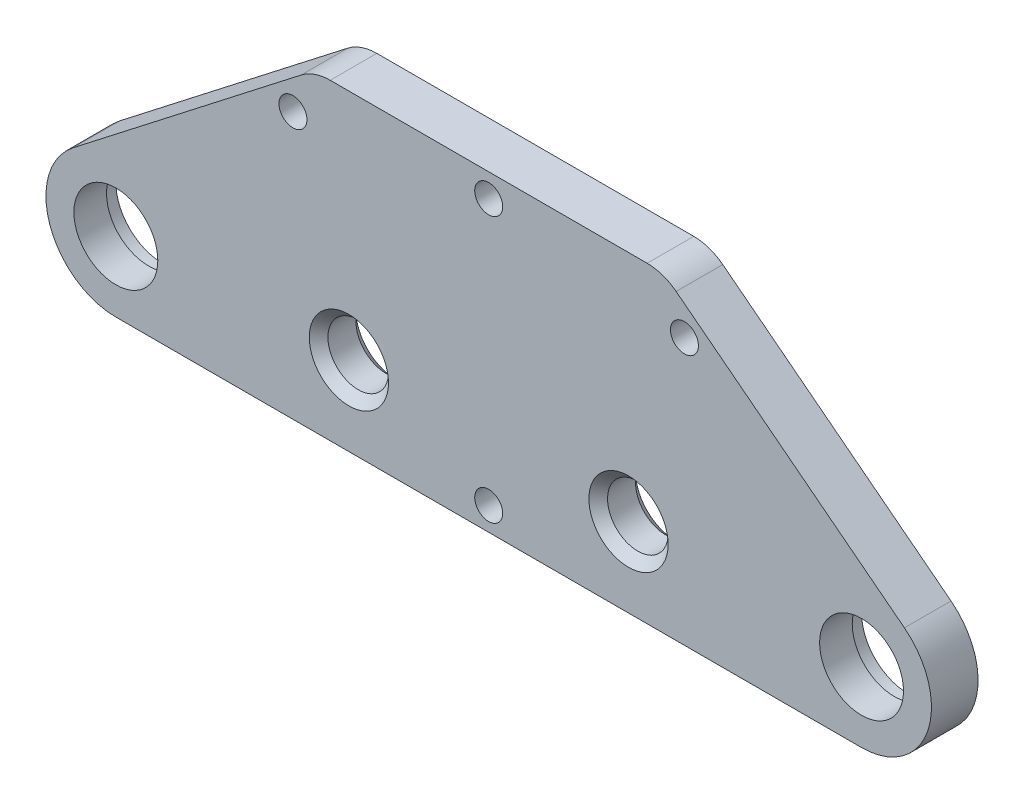
ISO-10303-21;
HEADER;
FILE_DESCRIPTION(('STEP AP214'),'2;1');
FILE_NAME('part.step','',(''),(''),'','','');
FILE_SCHEMA(('AUTOMOTIVE_DESIGN { 1 0 10303 214 1 1 1 1 }'));
ENDSEC;
DATA;
#1=APPLICATION_CONTEXT('core data for automotive mechanical design processes');
#2=APPLICATION_PROTOCOL_DEFINITION('international standard','automotive_design',2000,#1);
#3=PRODUCT_CONTEXT('',#1,'mechanical');
#4=PRODUCT('Part','Part','',(#3));
#5=PRODUCT_RELATED_PRODUCT_CATEGORY('part','',(#4));
#6=PRODUCT_DEFINITION_FORMATION('','',#4);
#7=PRODUCT_DEFINITION_CONTEXT('part definition',#1,'design');
#8=PRODUCT_DEFINITION('design','',#6,#7);
#9=PRODUCT_DEFINITION_SHAPE('','',#8);
#10=(LENGTH_UNIT() NAMED_UNIT(*) SI_UNIT(.MILLI.,.METRE.));
#11=(NAMED_UNIT(*) PLANE_ANGLE_UNIT() SI_UNIT($,.RADIAN.));
#12=(NAMED_UNIT(*) SI_UNIT($,.STERADIAN.) SOLID_ANGLE_UNIT());
#13=UNCERTAINTY_MEASURE_WITH_UNIT(LENGTH_MEASURE(1.E-05),#10,'distance_accuracy_value','');
#14=(GEOMETRIC_REPRESENTATION_CONTEXT(3) GLOBAL_UNCERTAINTY_ASSIGNED_CONTEXT((#13)) GLOBAL_UNIT_ASSIGNED_CONTEXT((#10,
#11,#12)) REPRESENTATION_CONTEXT('',''));
#15=CARTESIAN_POINT('',(0.,0.,0.));
#16=DIRECTION('',(0.,0.,1.));
#17=DIRECTION('',(1.,0.,0.));
#18=AXIS2_PLACEMENT_3D('',#15,#16,#17);
#19=CARTESIAN_POINT('',(-40.,-1.,5.5));
#20=DIRECTION('',(0.,0.,-1.));
#21=DIRECTION('',(-1.,0.,0.));
#22=AXIS2_PLACEMENT_3D('',#19,#20,#21);
#23=CYLINDRICAL_SURFACE('',#22,4.5);
#24=CARTESIAN_POINT('',(-40.,-1.,2.5));
#25=DIRECTION('',(0.,0.,1.));
#26=DIRECTION('',(1.,0.,0.));
#27=AXIS2_PLACEMENT_3D('',#24,#25,#26);
#28=CIRCLE('',#27,4.5);
#29=CARTESIAN_POINT('',(-35.5,-1.,2.5));
#30=VERTEX_POINT('',#29);
#31=EDGE_CURVE('E204',#30,#30,#28,.F.);
#32=ORIENTED_EDGE('',*,*,#31,.F.);
#33=EDGE_LOOP('',(#32));
#34=FACE_BOUND('',#33,.T.);
#35=CARTESIAN_POINT('',(-40.,-1.,-1.));
#36=DIRECTION('',(0.,0.,-1.));
#37=DIRECTION('',(-1.,0.,0.));
#38=AXIS2_PLACEMENT_3D('',#35,#36,#37);
#39=CIRCLE('',#38,4.5);
#40=CARTESIAN_POINT('',(-44.5,-1.,-1.));
#41=VERTEX_POINT('',#40);
#42=EDGE_CURVE('E200',#41,#41,#39,.T.);
#43=ORIENTED_EDGE('',*,*,#42,.T.);
#44=EDGE_LOOP('',(#43));
#45=FACE_BOUND('',#44,.T.);
#46=ADVANCED_FACE('F45',(#34,#45),#23,.F.);
#47=CARTESIAN_POINT('',(40.,-1.,5.5));
#48=DIRECTION('',(0.,0.,-1.));
#49=DIRECTION('',(-1.,0.,0.));
#50=AXIS2_PLACEMENT_3D('',#47,#48,#49);
#51=CYLINDRICAL_SURFACE('',#50,4.5);
#52=CARTESIAN_POINT('',(40.,-1.,2.5));
#53=DIRECTION('',(0.,0.,1.));
#54=DIRECTION('',(1.,0.,0.));
#55=AXIS2_PLACEMENT_3D('',#52,#53,#54);
#56=CIRCLE('',#55,4.5);
#57=CARTESIAN_POINT('',(44.5,-1.,2.5));
#58=VERTEX_POINT('',#57);
#59=EDGE_CURVE('E154',#58,#58,#56,.T.);
#60=ORIENTED_EDGE('',*,*,#59,.T.);
#61=EDGE_LOOP('',(#60));
#62=FACE_BOUND('',#61,.T.);
#63=CARTESIAN_POINT('',(40.,-1.,-1.));
#64=DIRECTION('',(0.,0.,-1.));
#65=DIRECTION('',(-1.,0.,0.));
#66=AXIS2_PLACEMENT_3D('',#63,#64,#65);
#67=CIRCLE('',#66,4.5);
#68=CARTESIAN_POINT('',(35.5,-1.,-1.));
#69=VERTEX_POINT('',#68);
#70=EDGE_CURVE('E195',#69,#69,#67,.F.);
#71=ORIENTED_EDGE('',*,*,#70,.F.);
#72=EDGE_LOOP('',(#71));
#73=FACE_BOUND('',#72,.T.);
#74=ADVANCED_FACE('F273',(#62,#73),#51,.F.);
#75=CARTESIAN_POINT('',(40.0000000000001,-0.999999999999909,2.5));
#76=DIRECTION('',(0.,0.,-1.));
#77=DIRECTION('',(-1.,0.,0.));
#78=AXIS2_PLACEMENT_3D('',#75,#76,#77);
#79=CYLINDRICAL_SURFACE('',#78,7.50000000000004);
#80=CARTESIAN_POINT('',(40.0000000000001,-0.999999999999909,-2.5));
#81=DIRECTION('',(0.,0.,1.));
#82=DIRECTION('',(1.,0.,0.));
#83=AXIS2_PLACEMENT_3D('',#80,#81,#82);
#84=CIRCLE('',#83,7.50000000000004);
#85=CARTESIAN_POINT('',(40.0000000000002,-8.5,-2.5));
#86=VERTEX_POINT('',#85);
#87=CARTESIAN_POINT('',(44.5990946060003,4.92438425535182,-2.5));
#88=VERTEX_POINT('',#87);
#89=EDGE_CURVE('E149',#86,#88,#84,.T.);
#90=ORIENTED_EDGE('',*,*,#89,.T.);
#91=DIRECTION('',(0.,0.,-1.));
#92=VECTOR('',#91,1.);
#93=CARTESIAN_POINT('',(44.5990946060003,4.92438425535182,2.5));
#94=LINE('',#93,#92);
#95=CARTESIAN_POINT('',(44.5990946060003,4.92438425535182,2.5));
#96=VERTEX_POINT('',#95);
#97=EDGE_CURVE('E191',#96,#88,#94,.T.);
#98=ORIENTED_EDGE('',*,*,#97,.F.);
#99=CARTESIAN_POINT('',(40.0000000000001,-0.999999999999909,2.5));
#100=DIRECTION('',(0.,0.,1.));
#101=DIRECTION('',(1.,0.,0.));
#102=AXIS2_PLACEMENT_3D('',#99,#100,#101);
#103=CIRCLE('',#102,7.50000000000004);
#104=CARTESIAN_POINT('',(40.0000000000002,-8.5,2.5));
#105=VERTEX_POINT('',#104);
#106=EDGE_CURVE('E172',#105,#96,#103,.T.);
#107=ORIENTED_EDGE('',*,*,#106,.F.);
#108=DIRECTION('',(0.,0.,-1.));
#109=VECTOR('',#108,1.);
#110=CARTESIAN_POINT('',(40.0000000000002,-8.5,2.5));
#111=LINE('',#110,#109);
#112=EDGE_CURVE('E145',#105,#86,#111,.T.);
#113=ORIENTED_EDGE('',*,*,#112,.T.);
#114=EDGE_LOOP('',(#90,#98,#107,#113));
#115=FACE_BOUND('',#114,.T.);
#116=ADVANCED_FACE('F260',(#115),#79,.T.);
#117=CARTESIAN_POINT('',(44.5990946060003,4.92438425535182,2.5));
#118=DIRECTION('',(-0.613212614133353,-0.789917900713574,0.));
#119=DIRECTION('',(0.789917900713574,-0.613212614133353,0.));
#120=AXIS2_PLACEMENT_3D('',#117,#118,#119);
#121=PLANE('',#120);
#122=DIRECTION('',(-0.789917900713574,0.613212614133353,0.));
#123=VECTOR('',#122,1.);
#124=CARTESIAN_POINT('',(44.5990946060003,4.92438425535182,-2.5));
#125=LINE('',#124,#123);
#126=CARTESIAN_POINT('',(20.1116396838795,23.9339752934858,-2.5));
#127=VERTEX_POINT('',#126);
#128=EDGE_CURVE('E153',#88,#127,#125,.T.);
#129=ORIENTED_EDGE('',*,*,#128,.T.);
#130=DIRECTION('',(0.,0.,-1.));
#131=VECTOR('',#130,1.);
#132=CARTESIAN_POINT('',(20.1116396838795,23.9339752934858,2.5));
#133=LINE('',#132,#131);
#134=CARTESIAN_POINT('',(20.1116396838795,23.9339752934858,2.5));
#135=VERTEX_POINT('',#134);
#136=EDGE_CURVE('E187',#135,#127,#133,.T.);
#137=ORIENTED_EDGE('',*,*,#136,.F.);
#138=DIRECTION('',(-0.789917900713574,0.613212614133353,0.));
#139=VECTOR('',#138,1.);
#140=CARTESIAN_POINT('',(44.5990946060003,4.92438425535182,2.5));
#141=LINE('',#140,#139);
#142=EDGE_CURVE('E108',#96,#135,#141,.T.);
#143=ORIENTED_EDGE('',*,*,#142,.F.);
#144=ORIENTED_EDGE('',*,*,#97,.T.);
#145=EDGE_LOOP('',(#129,#137,#143,#144));
#146=FACE_BOUND('',#145,.T.);
#147=ADVANCED_FACE('F334',(#146),#121,.F.);
#148=CARTESIAN_POINT('',(17.0000000000001,19.9256756756756,2.5));
#149=DIRECTION('',(0.,0.,-1.));
#150=DIRECTION('',(-1.,0.,0.));
#151=AXIS2_PLACEMENT_3D('',#148,#149,#150);
#152=CYLINDRICAL_SURFACE('',#151,5.07432432432443);
#153=CARTESIAN_POINT('',(17.0000000000001,19.9256756756756,-2.5));
#154=DIRECTION('',(0.,0.,1.));
#155=DIRECTION('',(1.,0.,0.));
#156=AXIS2_PLACEMENT_3D('',#153,#154,#155);
#157=CIRCLE('',#156,5.07432432432443);
#158=CARTESIAN_POINT('',(17.,25.,-2.5));
#159=VERTEX_POINT('',#158);
#160=EDGE_CURVE('E157',#127,#159,#157,.T.);
#161=ORIENTED_EDGE('',*,*,#160,.T.);
#162=DIRECTION('',(0.,0.,-1.));
#163=VECTOR('',#162,1.);
#164=CARTESIAN_POINT('',(17.,25.,2.5));
#165=LINE('',#164,#163);
#166=CARTESIAN_POINT('',(17.,25.,2.5));
#167=VERTEX_POINT('',#166);
#168=EDGE_CURVE('E183',#167,#159,#165,.T.);
#169=ORIENTED_EDGE('',*,*,#168,.F.);
#170=CARTESIAN_POINT('',(17.0000000000001,19.9256756756756,2.5));
#171=DIRECTION('',(0.,0.,1.));
#172=DIRECTION('',(1.,0.,0.));
#173=AXIS2_PLACEMENT_3D('',#170,#171,#172);
#174=CIRCLE('',#173,5.07432432432443);
#175=EDGE_CURVE('E316',#135,#167,#174,.T.);
#176=ORIENTED_EDGE('',*,*,#175,.F.);
#177=ORIENTED_EDGE('',*,*,#136,.T.);
#178=EDGE_LOOP('',(#161,#169,#176,#177));
#179=FACE_BOUND('',#178,.T.);
#180=ADVANCED_FACE('F333',(#179),#152,.T.);
#181=CARTESIAN_POINT('',(-17.,25.,2.5));
#182=DIRECTION('',(0.,-1.,0.));
#183=DIRECTION('',(0.,0.,-1.));
#184=AXIS2_PLACEMENT_3D('',#181,#182,#183);
#185=PLANE('',#184);
#186=DIRECTION('',(-1.,0.,0.));
#187=VECTOR('',#186,1.);
#188=CARTESIAN_POINT('',(-17.,25.,-2.5));
#189=LINE('',#188,#187);
#190=CARTESIAN_POINT('',(-17.,25.,-2.5));
#191=VERTEX_POINT('',#190);
#192=EDGE_CURVE('E160',#159,#191,#189,.T.);
#193=ORIENTED_EDGE('',*,*,#192,.T.);
#194=DIRECTION('',(0.,0.,-1.));
#195=VECTOR('',#194,1.);
#196=CARTESIAN_POINT('',(-17.,25.,2.5));
#197=LINE('',#196,#195);
#198=CARTESIAN_POINT('',(-17.,25.,2.5));
#199=VERTEX_POINT('',#198);
#200=EDGE_CURVE('E179',#199,#191,#197,.T.);
#201=ORIENTED_EDGE('',*,*,#200,.F.);
#202=DIRECTION('',(-1.,0.,0.));
#203=VECTOR('',#202,1.);
#204=CARTESIAN_POINT('',(-17.,25.,2.5));
#205=LINE('',#204,#203);
#206=EDGE_CURVE('E319',#167,#199,#205,.T.);
#207=ORIENTED_EDGE('',*,*,#206,.F.);
#208=ORIENTED_EDGE('',*,*,#168,.T.);
#209=EDGE_LOOP('',(#193,#201,#207,#208));
#210=FACE_BOUND('',#209,.T.);
#211=ADVANCED_FACE('F327',(#210),#185,.F.);
#212=CARTESIAN_POINT('',(-17.,19.9256756756756,2.5));
#213=DIRECTION('',(0.,0.,-1.));
#214=DIRECTION('',(-1.,0.,0.));
#215=AXIS2_PLACEMENT_3D('',#212,#213,#214);
#216=CYLINDRICAL_SURFACE('',#215,5.07432432432443);
#217=CARTESIAN_POINT('',(-17.,19.9256756756756,-2.5));
#218=DIRECTION('',(0.,0.,1.));
#219=DIRECTION('',(1.,0.,0.));
#220=AXIS2_PLACEMENT_3D('',#217,#218,#219);
#221=CIRCLE('',#220,5.07432432432443);
#222=CARTESIAN_POINT('',(-20.1116396838794,23.9339752934857,-2.5));
#223=VERTEX_POINT('',#222);
#224=EDGE_CURVE('E163',#191,#223,#221,.T.);
#225=ORIENTED_EDGE('',*,*,#224,.T.);
#226=DIRECTION('',(0.,0.,-1.));
#227=VECTOR('',#226,1.);
#228=CARTESIAN_POINT('',(-20.1116396838794,23.9339752934857,2.5));
#229=LINE('',#228,#227);
#230=CARTESIAN_POINT('',(-20.1116396838794,23.9339752934857,2.5));
#231=VERTEX_POINT('',#230);
#232=EDGE_CURVE('E138',#231,#223,#229,.T.);
#233=ORIENTED_EDGE('',*,*,#232,.F.);
#234=CARTESIAN_POINT('',(-17.,19.9256756756756,2.5));
#235=DIRECTION('',(0.,0.,1.));
#236=DIRECTION('',(1.,0.,0.));
#237=AXIS2_PLACEMENT_3D('',#234,#235,#236);
#238=CIRCLE('',#237,5.07432432432443);
#239=EDGE_CURVE('E127',#199,#231,#238,.T.);
#240=ORIENTED_EDGE('',*,*,#239,.F.);
#241=ORIENTED_EDGE('',*,*,#200,.T.);
#242=EDGE_LOOP('',(#225,#233,#240,#241));
#243=FACE_BOUND('',#242,.T.);
#244=ADVANCED_FACE('F331',(#243),#216,.T.);
#245=CARTESIAN_POINT('',(-44.5990946060002,4.92438425535182,2.5));
#246=DIRECTION('',(0.613212614133353,-0.789917900713574,0.));
#247=DIRECTION('',(0.789917900713574,0.613212614133353,0.));
#248=AXIS2_PLACEMENT_3D('',#245,#246,#247);
#249=PLANE('',#248);
#250=DIRECTION('',(-0.789917900713574,-0.613212614133353,0.));
#251=VECTOR('',#250,1.);
#252=CARTESIAN_POINT('',(-44.5990946060002,4.92438425535182,-2.5));
#253=LINE('',#252,#251);
#254=CARTESIAN_POINT('',(-44.5990946060002,4.92438425535179,-2.5));
#255=VERTEX_POINT('',#254);
#256=EDGE_CURVE('E136',#223,#255,#253,.T.);
#257=ORIENTED_EDGE('',*,*,#256,.T.);
#258=DIRECTION('',(0.,0.,-1.));
#259=VECTOR('',#258,1.);
#260=CARTESIAN_POINT('',(-44.5990946060002,4.92438425535179,2.5));
#261=LINE('',#260,#259);
#262=CARTESIAN_POINT('',(-44.5990946060002,4.92438425535179,2.5));
#263=VERTEX_POINT('',#262);
#264=EDGE_CURVE('E133',#263,#255,#261,.T.);
#265=ORIENTED_EDGE('',*,*,#264,.F.);
#266=DIRECTION('',(-0.789917900713574,-0.613212614133353,0.));
#267=VECTOR('',#266,1.);
#268=CARTESIAN_POINT('',(-44.5990946060002,4.92438425535182,2.5));
#269=LINE('',#268,#267);
#270=EDGE_CURVE('E121',#231,#263,#269,.T.);
#271=ORIENTED_EDGE('',*,*,#270,.F.);
#272=ORIENTED_EDGE('',*,*,#232,.T.);
#273=EDGE_LOOP('',(#257,#265,#271,#272));
#274=FACE_BOUND('',#273,.T.);
#275=ADVANCED_FACE('F134',(#274),#249,.F.);
#276=CARTESIAN_POINT('',(-40.,-0.999999999999995,2.5));
#277=DIRECTION('',(0.,0.,-1.));
#278=DIRECTION('',(-1.,0.,0.));
#279=AXIS2_PLACEMENT_3D('',#276,#277,#278);
#280=CYLINDRICAL_SURFACE('',#279,7.50000000000004);
#281=CARTESIAN_POINT('',(-40.,-0.999999999999995,-2.5));
#282=DIRECTION('',(0.,0.,1.));
#283=DIRECTION('',(1.,0.,0.));
#284=AXIS2_PLACEMENT_3D('',#281,#282,#283);
#285=CIRCLE('',#284,7.50000000000004);
#286=CARTESIAN_POINT('',(-40.,-8.5,-2.5));
#287=VERTEX_POINT('',#286);
#288=EDGE_CURVE('E93',#255,#287,#285,.T.);
#289=ORIENTED_EDGE('',*,*,#288,.T.);
#290=DIRECTION('',(0.,0.,-1.));
#291=VECTOR('',#290,1.);
#292=CARTESIAN_POINT('',(-40.,-8.5,2.5));
#293=LINE('',#292,#291);
#294=CARTESIAN_POINT('',(-40.,-8.5,2.5));
#295=VERTEX_POINT('',#294);
#296=EDGE_CURVE('E139',#295,#287,#293,.T.);
#297=ORIENTED_EDGE('',*,*,#296,.F.);
#298=CARTESIAN_POINT('',(-40.,-0.999999999999995,2.5));
#299=DIRECTION('',(0.,0.,1.));
#300=DIRECTION('',(1.,0.,0.));
#301=AXIS2_PLACEMENT_3D('',#298,#299,#300);
#302=CIRCLE('',#301,7.50000000000004);
#303=EDGE_CURVE('E125',#263,#295,#302,.T.);
#304=ORIENTED_EDGE('',*,*,#303,.F.);
#305=ORIENTED_EDGE('',*,*,#264,.T.);
#306=EDGE_LOOP('',(#289,#297,#304,#305));
#307=FACE_BOUND('',#306,.T.);
#308=ADVANCED_FACE('F141',(#307),#280,.T.);
#309=CARTESIAN_POINT('',(-40.,-8.5,2.5));
#310=DIRECTION('',(0.,1.,0.));
#311=DIRECTION('',(0.,0.,1.));
#312=AXIS2_PLACEMENT_3D('',#309,#310,#311);
#313=PLANE('',#312);
#314=DIRECTION('',(1.,0.,0.));
#315=VECTOR('',#314,1.);
#316=CARTESIAN_POINT('',(-40.,-8.5,-2.5));
#317=LINE('',#316,#315);
#318=EDGE_CURVE('E99',#287,#86,#317,.T.);
#319=ORIENTED_EDGE('',*,*,#318,.T.);
#320=ORIENTED_EDGE('',*,*,#112,.F.);
#321=DIRECTION('',(1.,0.,0.));
#322=VECTOR('',#321,1.);
#323=CARTESIAN_POINT('',(-40.,-8.5,2.5));
#324=LINE('',#323,#322);
#325=EDGE_CURVE('E64',#295,#105,#324,.T.);
#326=ORIENTED_EDGE('',*,*,#325,.F.);
#327=ORIENTED_EDGE('',*,*,#296,.T.);
#328=EDGE_LOOP('',(#319,#320,#326,#327));
#329=FACE_BOUND('',#328,.T.);
#330=ADVANCED_FACE('F262',(#329),#313,.F.);
#331=CARTESIAN_POINT('',(40.0000000000001,-0.999999999999909,2.5));
#332=DIRECTION('',(0.,0.,1.));
#333=DIRECTION('',(1.,0.,0.));
#334=AXIS2_PLACEMENT_3D('',#331,#332,#333);
#335=PLANE('',#334);
#336=CARTESIAN_POINT('',(0.,22.5,2.5));
#337=DIRECTION('',(0.,0.,1.));
#338=DIRECTION('',(1.,0.,0.));
#339=AXIS2_PLACEMENT_3D('',#336,#337,#338);
#340=CIRCLE('',#339,1.5);
#341=CARTESIAN_POINT('',(1.5,22.5,2.5));
#342=VERTEX_POINT('',#341);
#343=EDGE_CURVE('E442',#342,#342,#340,.T.);
#344=ORIENTED_EDGE('',*,*,#343,.F.);
#345=EDGE_LOOP('',(#344));
#346=FACE_BOUND('',#345,.T.);
#347=CARTESIAN_POINT('',(21.,20.0794560466247,2.5));
#348=DIRECTION('',(0.,0.,1.));
#349=DIRECTION('',(1.,0.,0.));
#350=AXIS2_PLACEMENT_3D('',#347,#348,#349);
#351=CIRCLE('',#350,1.5);
#352=CARTESIAN_POINT('',(22.5,20.0794560466247,2.5));
#353=VERTEX_POINT('',#352);
#354=EDGE_CURVE('E457',#353,#353,#351,.T.);
#355=ORIENTED_EDGE('',*,*,#354,.F.);
#356=EDGE_LOOP('',(#355));
#357=FACE_BOUND('',#356,.T.);
#358=CARTESIAN_POINT('',(0.,-6.00000000000013,2.5));
#359=DIRECTION('',(0.,0.,1.));
#360=DIRECTION('',(1.,0.,0.));
#361=AXIS2_PLACEMENT_3D('',#358,#359,#360);
#362=CIRCLE('',#361,1.5);
#363=CARTESIAN_POINT('',(1.5,-6.00000000000013,2.5));
#364=VERTEX_POINT('',#363);
#365=EDGE_CURVE('E461',#364,#364,#362,.T.);
#366=ORIENTED_EDGE('',*,*,#365,.F.);
#367=EDGE_LOOP('',(#366));
#368=FACE_BOUND('',#367,.T.);
#369=CARTESIAN_POINT('',(-21.,20.0794560466247,2.5));
#370=DIRECTION('',(0.,0.,1.));
#371=DIRECTION('',(-1.,0.,0.));
#372=AXIS2_PLACEMENT_3D('',#369,#370,#371);
#373=CIRCLE('',#372,1.5);
#374=CARTESIAN_POINT('',(-22.5,20.0794560466247,2.5));
#375=VERTEX_POINT('',#374);
#376=EDGE_CURVE('E447',#375,#375,#373,.T.);
#377=ORIENTED_EDGE('',*,*,#376,.F.);
#378=EDGE_LOOP('',(#377));
#379=FACE_BOUND('',#378,.T.);
#380=CARTESIAN_POINT('',(-15.,0.,2.5));
#381=DIRECTION('',(0.,0.,1.));
#382=DIRECTION('',(1.,0.,0.));
#383=AXIS2_PLACEMENT_3D('',#380,#381,#382);
#384=CIRCLE('',#383,4.24999999999999);
#385=CARTESIAN_POINT('',(-10.75,0.,2.5));
#386=VERTEX_POINT('',#385);
#387=EDGE_CURVE('E11',#386,#386,#384,.F.);
#388=ORIENTED_EDGE('',*,*,#387,.T.);
#389=EDGE_LOOP('',(#388));
#390=FACE_BOUND('',#389,.T.);
#391=CARTESIAN_POINT('',(15.,0.,2.5));
#392=DIRECTION('',(0.,0.,1.));
#393=DIRECTION('',(1.,0.,0.));
#394=AXIS2_PLACEMENT_3D('',#391,#392,#393);
#395=CIRCLE('',#394,4.25000000000002);
#396=CARTESIAN_POINT('',(19.25,0.,2.5));
#397=VERTEX_POINT('',#396);
#398=EDGE_CURVE('E217',#397,#397,#395,.F.);
#399=ORIENTED_EDGE('',*,*,#398,.T.);
#400=EDGE_LOOP('',(#399));
#401=FACE_BOUND('',#400,.T.);
#402=ORIENTED_EDGE('',*,*,#31,.T.);
#403=EDGE_LOOP('',(#402));
#404=FACE_BOUND('',#403,.T.);
#405=ORIENTED_EDGE('',*,*,#59,.F.);
#406=EDGE_LOOP('',(#405));
#407=FACE_BOUND('',#406,.T.);
#408=ORIENTED_EDGE('',*,*,#106,.T.);
#409=ORIENTED_EDGE('',*,*,#142,.T.);
#410=ORIENTED_EDGE('',*,*,#175,.T.);
#411=ORIENTED_EDGE('',*,*,#206,.T.);
#412=ORIENTED_EDGE('',*,*,#239,.T.);
#413=ORIENTED_EDGE('',*,*,#270,.T.);
#414=ORIENTED_EDGE('',*,*,#303,.T.);
#415=ORIENTED_EDGE('',*,*,#325,.T.);
#416=EDGE_LOOP('',(#408,#409,#410,#411,#412,#413,#414,#415));
#417=FACE_BOUND('',#416,.T.);
#418=ADVANCED_FACE('F123',(#346,#357,#368,#379,#390,#401,#404,#407,#417),#335,.T.);
#419=CARTESIAN_POINT('',(40.0000000000001,-0.999999999999909,-2.5));
#420=DIRECTION('',(0.,0.,1.));
#421=DIRECTION('',(1.,0.,0.));
#422=AXIS2_PLACEMENT_3D('',#419,#420,#421);
#423=PLANE('',#422);
#424=CARTESIAN_POINT('',(30.,12.5,-2.5));
#425=DIRECTION('',(0.,0.,-1.));
#426=DIRECTION('',(1.,0.,0.));
#427=AXIS2_PLACEMENT_3D('',#424,#425,#426);
#428=CIRCLE('',#427,2.);
#429=CARTESIAN_POINT('',(32.,12.5,-2.5));
#430=VERTEX_POINT('',#429);
#431=EDGE_CURVE('E481',#430,#430,#428,.T.);
#432=ORIENTED_EDGE('',*,*,#431,.F.);
#433=EDGE_LOOP('',(#432));
#434=FACE_BOUND('',#433,.T.);
#435=CARTESIAN_POINT('',(-30.,12.5,-2.5));
#436=DIRECTION('',(0.,0.,-1.));
#437=DIRECTION('',(-1.,0.,0.));
#438=AXIS2_PLACEMENT_3D('',#435,#436,#437);
#439=CIRCLE('',#438,2.);
#440=CARTESIAN_POINT('',(-32.,12.5,-2.5));
#441=VERTEX_POINT('',#440);
#442=EDGE_CURVE('E472',#441,#441,#439,.T.);
#443=ORIENTED_EDGE('',*,*,#442,.F.);
#444=EDGE_LOOP('',(#443));
#445=FACE_BOUND('',#444,.T.);
#446=CARTESIAN_POINT('',(0.,15.,-2.5));
#447=DIRECTION('',(0.,0.,-1.));
#448=DIRECTION('',(-1.,0.,0.));
#449=AXIS2_PLACEMENT_3D('',#446,#447,#448);
#450=CIRCLE('',#449,2.);
#451=CARTESIAN_POINT('',(-2.,15.,-2.5));
#452=VERTEX_POINT('',#451);
#453=EDGE_CURVE('E476',#452,#452,#450,.T.);
#454=ORIENTED_EDGE('',*,*,#453,.F.);
#455=EDGE_LOOP('',(#454));
#456=FACE_BOUND('',#455,.T.);
#457=CARTESIAN_POINT('',(-15.,0.,-2.5));
#458=DIRECTION('',(0.,0.,1.));
#459=DIRECTION('',(1.,0.,0.));
#460=AXIS2_PLACEMENT_3D('',#457,#458,#459);
#461=CIRCLE('',#460,4.25000000000002);
#462=CARTESIAN_POINT('',(-10.75,0.,-2.5));
#463=VERTEX_POINT('',#462);
#464=EDGE_CURVE('E221',#463,#463,#461,.T.);
#465=ORIENTED_EDGE('',*,*,#464,.T.);
#466=EDGE_LOOP('',(#465));
#467=FACE_BOUND('',#466,.T.);
#468=CARTESIAN_POINT('',(15.,0.,-2.5));
#469=DIRECTION('',(0.,0.,1.));
#470=DIRECTION('',(1.,0.,0.));
#471=AXIS2_PLACEMENT_3D('',#468,#469,#470);
#472=CIRCLE('',#471,4.24999999999999);
#473=CARTESIAN_POINT('',(19.25,0.,-2.5));
#474=VERTEX_POINT('',#473);
#475=EDGE_CURVE('E213',#474,#474,#472,.T.);
#476=ORIENTED_EDGE('',*,*,#475,.T.);
#477=EDGE_LOOP('',(#476));
#478=FACE_BOUND('',#477,.T.);
#479=CARTESIAN_POINT('',(-40.,-1.,-2.5));
#480=DIRECTION('',(0.,0.,1.));
#481=DIRECTION('',(1.,0.,0.));
#482=AXIS2_PLACEMENT_3D('',#479,#480,#481);
#483=CIRCLE('',#482,5.);
#484=CARTESIAN_POINT('',(-35.,-1.,-2.5));
#485=VERTEX_POINT('',#484);
#486=EDGE_CURVE('E251',#485,#485,#483,.T.);
#487=ORIENTED_EDGE('',*,*,#486,.T.);
#488=EDGE_LOOP('',(#487));
#489=FACE_BOUND('',#488,.T.);
#490=CARTESIAN_POINT('',(40.,-1.,-2.5));
#491=DIRECTION('',(0.,0.,-1.));
#492=DIRECTION('',(-1.,0.,0.));
#493=AXIS2_PLACEMENT_3D('',#490,#491,#492);
#494=CIRCLE('',#493,5.);
#495=CARTESIAN_POINT('',(35.,-1.,-2.5));
#496=VERTEX_POINT('',#495);
#497=EDGE_CURVE('E255',#496,#496,#494,.T.);
#498=ORIENTED_EDGE('',*,*,#497,.F.);
#499=EDGE_LOOP('',(#498));
#500=FACE_BOUND('',#499,.T.);
#501=ORIENTED_EDGE('',*,*,#89,.F.);
#502=ORIENTED_EDGE('',*,*,#318,.F.);
#503=ORIENTED_EDGE('',*,*,#288,.F.);
#504=ORIENTED_EDGE('',*,*,#256,.F.);
#505=ORIENTED_EDGE('',*,*,#224,.F.);
#506=ORIENTED_EDGE('',*,*,#192,.F.);
#507=ORIENTED_EDGE('',*,*,#160,.F.);
#508=ORIENTED_EDGE('',*,*,#128,.F.);
#509=EDGE_LOOP('',(#501,#502,#503,#504,#505,#506,#507,#508));
#510=FACE_BOUND('',#509,.T.);
#511=ADVANCED_FACE('F240',(#434,#445,#456,#467,#478,#489,#500,#510),#423,.F.);
#512=CARTESIAN_POINT('',(40.,-1.,-1.));
#513=DIRECTION('',(0.,0.,-1.));
#514=DIRECTION('',(-1.,0.,0.));
#515=AXIS2_PLACEMENT_3D('',#512,#513,#514);
#516=PLANE('',#515);
#517=CARTESIAN_POINT('',(40.,-1.,-1.));
#518=DIRECTION('',(0.,0.,-1.));
#519=DIRECTION('',(-1.,0.,0.));
#520=AXIS2_PLACEMENT_3D('',#517,#518,#519);
#521=CIRCLE('',#520,5.);
#522=CARTESIAN_POINT('',(35.,-1.,-1.));
#523=VERTEX_POINT('',#522);
#524=EDGE_CURVE('E199',#523,#523,#521,.T.);
#525=ORIENTED_EDGE('',*,*,#524,.T.);
#526=EDGE_LOOP('',(#525));
#527=FACE_BOUND('',#526,.T.);
#528=ORIENTED_EDGE('',*,*,#70,.T.);
#529=EDGE_LOOP('',(#528));
#530=FACE_BOUND('',#529,.T.);
#531=ADVANCED_FACE('F243',(#527,#530),#516,.T.);
#532=CARTESIAN_POINT('',(40.,-1.,-1.));
#533=DIRECTION('',(0.,0.,-1.));
#534=DIRECTION('',(-1.,0.,0.));
#535=AXIS2_PLACEMENT_3D('',#532,#533,#534);
#536=CYLINDRICAL_SURFACE('',#535,5.);
#537=ORIENTED_EDGE('',*,*,#524,.F.);
#538=EDGE_LOOP('',(#537));
#539=FACE_BOUND('',#538,.T.);
#540=ORIENTED_EDGE('',*,*,#497,.T.);
#541=EDGE_LOOP('',(#540));
#542=FACE_BOUND('',#541,.T.);
#543=ADVANCED_FACE('F289',(#539,#542),#536,.F.);
#544=CARTESIAN_POINT('',(-40.,-1.,-1.));
#545=DIRECTION('',(0.,0.,-1.));
#546=DIRECTION('',(-1.,0.,0.));
#547=AXIS2_PLACEMENT_3D('',#544,#545,#546);
#548=CYLINDRICAL_SURFACE('',#547,5.);
#549=CARTESIAN_POINT('',(-40.,-1.,-1.));
#550=DIRECTION('',(0.,0.,1.));
#551=DIRECTION('',(1.,0.,0.));
#552=AXIS2_PLACEMENT_3D('',#549,#550,#551);
#553=CIRCLE('',#552,5.);
#554=CARTESIAN_POINT('',(-35.,-1.,-1.));
#555=VERTEX_POINT('',#554);
#556=EDGE_CURVE('E205',#555,#555,#553,.T.);
#557=ORIENTED_EDGE('',*,*,#556,.T.);
#558=EDGE_LOOP('',(#557));
#559=FACE_BOUND('',#558,.T.);
#560=ORIENTED_EDGE('',*,*,#486,.F.);
#561=EDGE_LOOP('',(#560));
#562=FACE_BOUND('',#561,.T.);
#563=ADVANCED_FACE('F285',(#559,#562),#548,.F.);
#564=CARTESIAN_POINT('',(-40.,-1.,-1.));
#565=DIRECTION('',(0.,0.,-1.));
#566=DIRECTION('',(1.,0.,0.));
#567=AXIS2_PLACEMENT_3D('',#564,#565,#566);
#568=PLANE('',#567);
#569=ORIENTED_EDGE('',*,*,#42,.F.);
#570=EDGE_LOOP('',(#569));
#571=FACE_BOUND('',#570,.T.);
#572=ORIENTED_EDGE('',*,*,#556,.F.);
#573=EDGE_LOOP('',(#572));
#574=FACE_BOUND('',#573,.T.);
#575=ADVANCED_FACE('F296',(#571,#574),#568,.T.);
#576=CARTESIAN_POINT('',(15.,0.,7.5));
#577=DIRECTION('',(0.,0.,-1.));
#578=DIRECTION('',(-1.,0.,0.));
#579=AXIS2_PLACEMENT_3D('',#576,#577,#578);
#580=CYLINDRICAL_SURFACE('',#579,3.25);
#581=CARTESIAN_POINT('',(15.,0.,-1.50000000000001));
#582=DIRECTION('',(0.,0.,1.));
#583=DIRECTION('',(1.,0.,0.));
#584=AXIS2_PLACEMENT_3D('',#581,#582,#583);
#585=CIRCLE('',#584,3.25);
#586=CARTESIAN_POINT('',(18.25,0.,-1.50000000000001));
#587=VERTEX_POINT('',#586);
#588=EDGE_CURVE('E209',#587,#587,#585,.F.);
#589=ORIENTED_EDGE('',*,*,#588,.T.);
#590=EDGE_LOOP('',(#589));
#591=FACE_BOUND('',#590,.T.);
#592=CARTESIAN_POINT('',(15.,0.,1.49999999999999));
#593=DIRECTION('',(0.,0.,1.));
#594=DIRECTION('',(1.,0.,0.));
#595=AXIS2_PLACEMENT_3D('',#592,#593,#594);
#596=CIRCLE('',#595,3.25);
#597=CARTESIAN_POINT('',(18.25,0.,1.49999999999999));
#598=VERTEX_POINT('',#597);
#599=EDGE_CURVE('E194',#598,#598,#596,.T.);
#600=ORIENTED_EDGE('',*,*,#599,.T.);
#601=EDGE_LOOP('',(#600));
#602=FACE_BOUND('',#601,.T.);
#603=ADVANCED_FACE('F353',(#591,#602),#580,.F.);
#604=CARTESIAN_POINT('',(15.,0.,-1.50000000000001));
#605=DIRECTION('',(0.,0.,-1.));
#606=DIRECTION('',(-1.,0.,0.));
#607=AXIS2_PLACEMENT_3D('',#604,#605,#606);
#608=CONICAL_SURFACE('',#607,3.25,0.78539816339745);
#609=ORIENTED_EDGE('',*,*,#475,.F.);
#610=EDGE_LOOP('',(#609));
#611=FACE_BOUND('',#610,.T.);
#612=ORIENTED_EDGE('',*,*,#588,.F.);
#613=EDGE_LOOP('',(#612));
#614=FACE_BOUND('',#613,.T.);
#615=ADVANCED_FACE('F346',(#611,#614),#608,.F.);
#616=CARTESIAN_POINT('',(15.,0.,1.49999999999999));
#617=DIRECTION('',(0.,0.,1.));
#618=DIRECTION('',(1.,0.,0.));
#619=AXIS2_PLACEMENT_3D('',#616,#617,#618);
#620=CONICAL_SURFACE('',#619,3.25,0.785398163397453);
#621=ORIENTED_EDGE('',*,*,#398,.F.);
#622=EDGE_LOOP('',(#621));
#623=FACE_BOUND('',#622,.T.);
#624=ORIENTED_EDGE('',*,*,#599,.F.);
#625=EDGE_LOOP('',(#624));
#626=FACE_BOUND('',#625,.T.);
#627=ADVANCED_FACE('F352',(#623,#626),#620,.F.);
#628=CARTESIAN_POINT('',(-15.,0.,7.5));
#629=DIRECTION('',(0.,0.,-1.));
#630=DIRECTION('',(-1.,0.,0.));
#631=AXIS2_PLACEMENT_3D('',#628,#629,#630);
#632=CYLINDRICAL_SURFACE('',#631,3.25);
#633=CARTESIAN_POINT('',(-15.,0.,-1.49999999999999));
#634=DIRECTION('',(0.,0.,1.));
#635=DIRECTION('',(1.,0.,0.));
#636=AXIS2_PLACEMENT_3D('',#633,#634,#635);
#637=CIRCLE('',#636,3.25);
#638=CARTESIAN_POINT('',(-11.75,0.,-1.49999999999999));
#639=VERTEX_POINT('',#638);
#640=EDGE_CURVE('E56',#639,#639,#637,.F.);
#641=ORIENTED_EDGE('',*,*,#640,.T.);
#642=EDGE_LOOP('',(#641));
#643=FACE_BOUND('',#642,.T.);
#644=CARTESIAN_POINT('',(-15.,0.,1.50000000000001));
#645=DIRECTION('',(0.,0.,1.));
#646=DIRECTION('',(1.,0.,0.));
#647=AXIS2_PLACEMENT_3D('',#644,#645,#646);
#648=CIRCLE('',#647,3.25);
#649=CARTESIAN_POINT('',(-11.75,0.,1.50000000000001));
#650=VERTEX_POINT('',#649);
#651=EDGE_CURVE('E225',#650,#650,#648,.T.);
#652=ORIENTED_EDGE('',*,*,#651,.T.);
#653=EDGE_LOOP('',(#652));
#654=FACE_BOUND('',#653,.T.);
#655=ADVANCED_FACE('F232',(#643,#654),#632,.F.);
#656=CARTESIAN_POINT('',(-15.,0.,-2.5));
#657=DIRECTION('',(0.,0.,-1.));
#658=DIRECTION('',(-1.,0.,0.));
#659=AXIS2_PLACEMENT_3D('',#656,#657,#658);
#660=CONICAL_SURFACE('',#659,4.25000000000002,0.785398163397453);
#661=ORIENTED_EDGE('',*,*,#640,.F.);
#662=EDGE_LOOP('',(#661));
#663=FACE_BOUND('',#662,.T.);
#664=ORIENTED_EDGE('',*,*,#464,.F.);
#665=EDGE_LOOP('',(#664));
#666=FACE_BOUND('',#665,.T.);
#667=ADVANCED_FACE('F235',(#663,#666),#660,.F.);
#668=CARTESIAN_POINT('',(-15.,0.,2.5));
#669=DIRECTION('',(0.,0.,1.));
#670=DIRECTION('',(1.,0.,0.));
#671=AXIS2_PLACEMENT_3D('',#668,#669,#670);
#672=CONICAL_SURFACE('',#671,4.24999999999999,0.78539816339745);
#673=ORIENTED_EDGE('',*,*,#651,.F.);
#674=EDGE_LOOP('',(#673));
#675=FACE_BOUND('',#674,.T.);
#676=ORIENTED_EDGE('',*,*,#387,.F.);
#677=EDGE_LOOP('',(#676));
#678=FACE_BOUND('',#677,.T.);
#679=ADVANCED_FACE('F48',(#675,#678),#672,.F.);
#680=CARTESIAN_POINT('',(0.,15.,0.5));
#681=DIRECTION('',(0.,0.,-1.));
#682=DIRECTION('',(-1.,0.,0.));
#683=AXIS2_PLACEMENT_3D('',#680,#681,#682);
#684=CYLINDRICAL_SURFACE('',#683,2.);
#685=CARTESIAN_POINT('',(0.,15.,0.5));
#686=DIRECTION('',(0.,0.,-1.));
#687=DIRECTION('',(-1.,0.,0.));
#688=AXIS2_PLACEMENT_3D('',#685,#686,#687);
#689=CIRCLE('',#688,2.);
#690=CARTESIAN_POINT('',(-2.,15.,0.5));
#691=VERTEX_POINT('',#690);
#692=EDGE_CURVE('E488',#691,#691,#689,.T.);
#693=ORIENTED_EDGE('',*,*,#692,.F.);
#694=EDGE_LOOP('',(#693));
#695=FACE_BOUND('',#694,.T.);
#696=ORIENTED_EDGE('',*,*,#453,.T.);
#697=EDGE_LOOP('',(#696));
#698=FACE_BOUND('',#697,.T.);
#699=ADVANCED_FACE('F380',(#695,#698),#684,.F.);
#700=CARTESIAN_POINT('',(0.,15.,0.5));
#701=DIRECTION('',(0.,0.,-1.));
#702=DIRECTION('',(-1.,0.,0.));
#703=AXIS2_PLACEMENT_3D('',#700,#701,#702);
#704=PLANE('',#703);
#705=ORIENTED_EDGE('',*,*,#692,.T.);
#706=EDGE_LOOP('',(#705));
#707=FACE_BOUND('',#706,.T.);
#708=ADVANCED_FACE('F383',(#707),#704,.T.);
#709=CARTESIAN_POINT('',(-30.,12.5,0.5));
#710=DIRECTION('',(0.,0.,-1.));
#711=DIRECTION('',(-1.,0.,0.));
#712=AXIS2_PLACEMENT_3D('',#709,#710,#711);
#713=CYLINDRICAL_SURFACE('',#712,2.);
#714=CARTESIAN_POINT('',(-30.,12.5,0.5));
#715=DIRECTION('',(0.,0.,-1.));
#716=DIRECTION('',(-1.,0.,0.));
#717=AXIS2_PLACEMENT_3D('',#714,#715,#716);
#718=CIRCLE('',#717,2.);
#719=CARTESIAN_POINT('',(-32.,12.5,0.5));
#720=VERTEX_POINT('',#719);
#721=EDGE_CURVE('E477',#720,#720,#718,.T.);
#722=ORIENTED_EDGE('',*,*,#721,.F.);
#723=EDGE_LOOP('',(#722));
#724=FACE_BOUND('',#723,.T.);
#725=ORIENTED_EDGE('',*,*,#442,.T.);
#726=EDGE_LOOP('',(#725));
#727=FACE_BOUND('',#726,.T.);
#728=ADVANCED_FACE('F387',(#724,#727),#713,.F.);
#729=CARTESIAN_POINT('',(-30.,12.5,0.5));
#730=DIRECTION('',(0.,0.,-1.));
#731=DIRECTION('',(-1.,0.,0.));
#732=AXIS2_PLACEMENT_3D('',#729,#730,#731);
#733=PLANE('',#732);
#734=ORIENTED_EDGE('',*,*,#721,.T.);
#735=EDGE_LOOP('',(#734));
#736=FACE_BOUND('',#735,.T.);
#737=ADVANCED_FACE('F397',(#736),#733,.T.);
#738=CARTESIAN_POINT('',(30.,12.5,0.5));
#739=DIRECTION('',(0.,0.,-1.));
#740=DIRECTION('',(-1.,0.,0.));
#741=AXIS2_PLACEMENT_3D('',#738,#739,#740);
#742=CYLINDRICAL_SURFACE('',#741,2.);
#743=CARTESIAN_POINT('',(30.,12.5,0.5));
#744=DIRECTION('',(0.,0.,-1.));
#745=DIRECTION('',(1.,0.,0.));
#746=AXIS2_PLACEMENT_3D('',#743,#744,#745);
#747=CIRCLE('',#746,2.);
#748=CARTESIAN_POINT('',(32.,12.5,0.5));
#749=VERTEX_POINT('',#748);
#750=EDGE_CURVE('E456',#749,#749,#747,.T.);
#751=ORIENTED_EDGE('',*,*,#750,.F.);
#752=EDGE_LOOP('',(#751));
#753=FACE_BOUND('',#752,.T.);
#754=ORIENTED_EDGE('',*,*,#431,.T.);
#755=EDGE_LOOP('',(#754));
#756=FACE_BOUND('',#755,.T.);
#757=ADVANCED_FACE('F393',(#753,#756),#742,.F.);
#758=CARTESIAN_POINT('',(30.,12.5,0.5));
#759=DIRECTION('',(0.,0.,1.));
#760=DIRECTION('',(1.,0.,0.));
#761=AXIS2_PLACEMENT_3D('',#758,#759,#760);
#762=PLANE('',#761);
#763=ORIENTED_EDGE('',*,*,#750,.T.);
#764=EDGE_LOOP('',(#763));
#765=FACE_BOUND('',#764,.T.);
#766=ADVANCED_FACE('F389',(#765),#762,.F.);
#767=CARTESIAN_POINT('',(-21.,20.0794560466247,-0.5));
#768=DIRECTION('',(0.,0.,1.));
#769=DIRECTION('',(1.,0.,0.));
#770=AXIS2_PLACEMENT_3D('',#767,#768,#769);
#771=CYLINDRICAL_SURFACE('',#770,1.5);
#772=CARTESIAN_POINT('',(-21.,20.0794560466247,-0.5));
#773=DIRECTION('',(0.,0.,1.));
#774=DIRECTION('',(-1.,0.,0.));
#775=AXIS2_PLACEMENT_3D('',#772,#773,#774);
#776=CIRCLE('',#775,1.5);
#777=CARTESIAN_POINT('',(-22.5,20.0794560466247,-0.5));
#778=VERTEX_POINT('',#777);
#779=EDGE_CURVE('E441',#778,#778,#776,.T.);
#780=ORIENTED_EDGE('',*,*,#779,.F.);
#781=EDGE_LOOP('',(#780));
#782=FACE_BOUND('',#781,.T.);
#783=ORIENTED_EDGE('',*,*,#376,.T.);
#784=EDGE_LOOP('',(#783));
#785=FACE_BOUND('',#784,.T.);
#786=ADVANCED_FACE('F392',(#782,#785),#771,.F.);
#787=CARTESIAN_POINT('',(-21.,20.0794560466247,-0.5));
#788=DIRECTION('',(0.,0.,-1.));
#789=DIRECTION('',(-1.,0.,0.));
#790=AXIS2_PLACEMENT_3D('',#787,#788,#789);
#791=PLANE('',#790);
#792=ORIENTED_EDGE('',*,*,#779,.T.);
#793=EDGE_LOOP('',(#792));
#794=FACE_BOUND('',#793,.T.);
#795=ADVANCED_FACE('F405',(#794),#791,.F.);
#796=CARTESIAN_POINT('',(0.,-6.00000000000013,-0.5));
#797=DIRECTION('',(0.,0.,1.));
#798=DIRECTION('',(1.,0.,0.));
#799=AXIS2_PLACEMENT_3D('',#796,#797,#798);
#800=CYLINDRICAL_SURFACE('',#799,1.5);
#801=CARTESIAN_POINT('',(0.,-6.00000000000013,-0.5));
#802=DIRECTION('',(0.,0.,1.));
#803=DIRECTION('',(1.,0.,0.));
#804=AXIS2_PLACEMENT_3D('',#801,#802,#803);
#805=CIRCLE('',#804,1.5);
#806=CARTESIAN_POINT('',(1.5,-6.00000000000013,-0.5));
#807=VERTEX_POINT('',#806);
#808=EDGE_CURVE('E465',#807,#807,#805,.T.);
#809=ORIENTED_EDGE('',*,*,#808,.F.);
#810=EDGE_LOOP('',(#809));
#811=FACE_BOUND('',#810,.T.);
#812=ORIENTED_EDGE('',*,*,#365,.T.);
#813=EDGE_LOOP('',(#812));
#814=FACE_BOUND('',#813,.T.);
#815=ADVANCED_FACE('F408',(#811,#814),#800,.F.);
#816=CARTESIAN_POINT('',(0.,-6.00000000000013,-0.5));
#817=DIRECTION('',(0.,0.,1.));
#818=DIRECTION('',(1.,0.,0.));
#819=AXIS2_PLACEMENT_3D('',#816,#817,#818);
#820=PLANE('',#819);
#821=ORIENTED_EDGE('',*,*,#808,.T.);
#822=EDGE_LOOP('',(#821));
#823=FACE_BOUND('',#822,.T.);
#824=ADVANCED_FACE('F413',(#823),#820,.T.);
#825=CARTESIAN_POINT('',(21.,20.0794560466247,-0.5));
#826=DIRECTION('',(0.,0.,1.));
#827=DIRECTION('',(1.,0.,0.));
#828=AXIS2_PLACEMENT_3D('',#825,#826,#827);
#829=CYLINDRICAL_SURFACE('',#828,1.5);
#830=CARTESIAN_POINT('',(21.,20.0794560466247,-0.5));
#831=DIRECTION('',(0.,0.,1.));
#832=DIRECTION('',(1.,0.,0.));
#833=AXIS2_PLACEMENT_3D('',#830,#831,#832);
#834=CIRCLE('',#833,1.5);
#835=CARTESIAN_POINT('',(22.5,20.0794560466247,-0.5));
#836=VERTEX_POINT('',#835);
#837=EDGE_CURVE('E452',#836,#836,#834,.T.);
#838=ORIENTED_EDGE('',*,*,#837,.F.);
#839=EDGE_LOOP('',(#838));
#840=FACE_BOUND('',#839,.T.);
#841=ORIENTED_EDGE('',*,*,#354,.T.);
#842=EDGE_LOOP('',(#841));
#843=FACE_BOUND('',#842,.T.);
#844=ADVANCED_FACE('F416',(#840,#843),#829,.F.);
#845=CARTESIAN_POINT('',(21.,20.0794560466247,-0.5));
#846=DIRECTION('',(0.,0.,1.));
#847=DIRECTION('',(1.,0.,0.));
#848=AXIS2_PLACEMENT_3D('',#845,#846,#847);
#849=PLANE('',#848);
#850=ORIENTED_EDGE('',*,*,#837,.T.);
#851=EDGE_LOOP('',(#850));
#852=FACE_BOUND('',#851,.T.);
#853=ADVANCED_FACE('F423',(#852),#849,.T.);
#854=CARTESIAN_POINT('',(0.,22.5,-4.74264068711929));
#855=DIRECTION('',(0.,0.,1.));
#856=DIRECTION('',(1.,0.,0.));
#857=AXIS2_PLACEMENT_3D('',#854,#855,#856);
#858=CYLINDRICAL_SURFACE('',#857,1.5);
#859=CARTESIAN_POINT('',(0.,22.5,-0.5));
#860=DIRECTION('',(0.,0.,1.));
#861=DIRECTION('',(1.,0.,0.));
#862=AXIS2_PLACEMENT_3D('',#859,#860,#861);
#863=CIRCLE('',#862,1.5);
#864=CARTESIAN_POINT('',(1.5,22.5,-0.5));
#865=VERTEX_POINT('',#864);
#866=EDGE_CURVE('E439',#865,#865,#863,.F.);
#867=ORIENTED_EDGE('',*,*,#866,.T.);
#868=EDGE_LOOP('',(#867));
#869=FACE_BOUND('',#868,.T.);
#870=ORIENTED_EDGE('',*,*,#343,.T.);
#871=EDGE_LOOP('',(#870));
#872=FACE_BOUND('',#871,.T.);
#873=ADVANCED_FACE('F427',(#869,#872),#858,.F.);
#874=CARTESIAN_POINT('',(0.,-6.00000000000013,-0.5));
#875=DIRECTION('',(0.,0.,1.));
#876=DIRECTION('',(1.,0.,0.));
#877=AXIS2_PLACEMENT_3D('',#874,#875,#876);
#878=PLANE('',#877);
#879=ORIENTED_EDGE('',*,*,#866,.F.);
#880=EDGE_LOOP('',(#879));
#881=FACE_BOUND('',#880,.T.);
#882=ADVANCED_FACE('F431',(#881),#878,.T.);
#883=CLOSED_SHELL('',(#46,#74,#116,#147,#180,#211,#244,#275,#308,#330,#418,#511,#531,#543,#563,
#575,#603,#615,#627,#655,#667,#679,#699,#708,#728,#737,#757,#766,#786,#795,#815,#824,#844,#853,
#873,#882));
#884=MANIFOLD_SOLID_BREP('B2',#883);
#885=ADVANCED_BREP_SHAPE_REPRESENTATION('',(#18,#884),#14);
#886=SHAPE_DEFINITION_REPRESENTATION(#9,#885);
ENDSEC;
END-ISO-10303-21;
